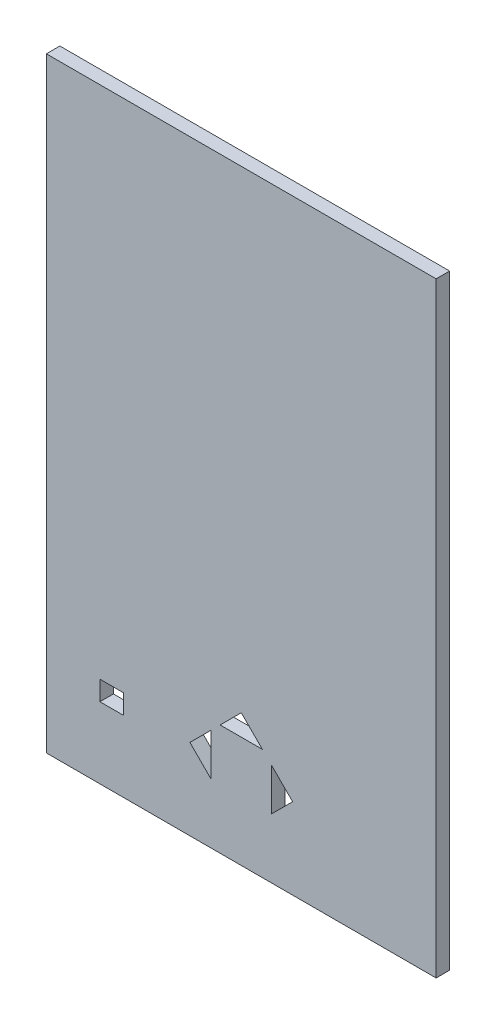
ISO-10303-21;
HEADER;
FILE_DESCRIPTION(('STEP AP214'),'2;1');
FILE_NAME('part.step','',(''),(''),'','','');
FILE_SCHEMA(('AUTOMOTIVE_DESIGN { 1 0 10303 214 1 1 1 1 }'));
ENDSEC;
DATA;
#1=APPLICATION_CONTEXT('core data for automotive mechanical design processes');
#2=APPLICATION_PROTOCOL_DEFINITION('international standard','automotive_design',2000,#1);
#3=PRODUCT_CONTEXT('',#1,'mechanical');
#4=PRODUCT('Part','Part','',(#3));
#5=PRODUCT_RELATED_PRODUCT_CATEGORY('part','',(#4));
#6=PRODUCT_DEFINITION_FORMATION('','',#4);
#7=PRODUCT_DEFINITION_CONTEXT('part definition',#1,'design');
#8=PRODUCT_DEFINITION('design','',#6,#7);
#9=PRODUCT_DEFINITION_SHAPE('','',#8);
#10=(LENGTH_UNIT() NAMED_UNIT(*) SI_UNIT(.MILLI.,.METRE.));
#11=(NAMED_UNIT(*) PLANE_ANGLE_UNIT() SI_UNIT($,.RADIAN.));
#12=(NAMED_UNIT(*) SI_UNIT($,.STERADIAN.) SOLID_ANGLE_UNIT());
#13=UNCERTAINTY_MEASURE_WITH_UNIT(LENGTH_MEASURE(1.E-05),#10,'distance_accuracy_value','');
#14=(GEOMETRIC_REPRESENTATION_CONTEXT(3) GLOBAL_UNCERTAINTY_ASSIGNED_CONTEXT((#13)) GLOBAL_UNIT_ASSIGNED_CONTEXT((#10,
#11,#12)) REPRESENTATION_CONTEXT('',''));
#15=CARTESIAN_POINT('',(0.,0.,0.));
#16=DIRECTION('',(0.,0.,1.));
#17=DIRECTION('',(1.,0.,0.));
#18=AXIS2_PLACEMENT_3D('',#15,#16,#17);
#19=CARTESIAN_POINT('',(-91.7625,142.5625,-6.35));
#20=DIRECTION('',(-1.,0.,0.));
#21=DIRECTION('',(0.,0.,1.));
#22=AXIS2_PLACEMENT_3D('',#19,#20,#21);
#23=PLANE('',#22);
#24=DIRECTION('',(0.,-1.,0.));
#25=VECTOR('',#24,1.);
#26=CARTESIAN_POINT('',(-91.7625,142.5625,0.));
#27=LINE('',#26,#25);
#28=CARTESIAN_POINT('',(-91.7625,142.5625,0.));
#29=VERTEX_POINT('',#28);
#30=CARTESIAN_POINT('',(-91.7625,-142.5625,0.));
#31=VERTEX_POINT('',#30);
#32=EDGE_CURVE('E184',#29,#31,#27,.T.);
#33=ORIENTED_EDGE('',*,*,#32,.F.);
#34=DIRECTION('',(0.,0.,1.));
#35=VECTOR('',#34,1.);
#36=CARTESIAN_POINT('',(-91.7625,142.5625,-6.35));
#37=LINE('',#36,#35);
#38=CARTESIAN_POINT('',(-91.7625,142.5625,-6.35));
#39=VERTEX_POINT('',#38);
#40=EDGE_CURVE('E11',#39,#29,#37,.T.);
#41=ORIENTED_EDGE('',*,*,#40,.F.);
#42=DIRECTION('',(0.,-1.,0.));
#43=VECTOR('',#42,1.);
#44=CARTESIAN_POINT('',(-91.7625,142.5625,-6.35));
#45=LINE('',#44,#43);
#46=CARTESIAN_POINT('',(-91.7625,-142.5625,-6.35));
#47=VERTEX_POINT('',#46);
#48=EDGE_CURVE('E263',#39,#47,#45,.T.);
#49=ORIENTED_EDGE('',*,*,#48,.T.);
#50=DIRECTION('',(0.,0.,1.));
#51=VECTOR('',#50,1.);
#52=CARTESIAN_POINT('',(-91.7625,-142.5625,-6.35));
#53=LINE('',#52,#51);
#54=EDGE_CURVE('E37',#47,#31,#53,.T.);
#55=ORIENTED_EDGE('',*,*,#54,.T.);
#56=EDGE_LOOP('',(#33,#41,#49,#55));
#57=FACE_BOUND('',#56,.T.);
#58=ADVANCED_FACE('F34',(#57),#23,.T.);
#59=CARTESIAN_POINT('',(91.7625,142.5625,-6.35));
#60=DIRECTION('',(0.,1.,0.));
#61=DIRECTION('',(0.,0.,1.));
#62=AXIS2_PLACEMENT_3D('',#59,#60,#61);
#63=PLANE('',#62);
#64=DIRECTION('',(-1.,0.,0.));
#65=VECTOR('',#64,1.);
#66=CARTESIAN_POINT('',(91.7625,142.5625,0.));
#67=LINE('',#66,#65);
#68=CARTESIAN_POINT('',(91.7625,142.5625,0.));
#69=VERTEX_POINT('',#68);
#70=EDGE_CURVE('E267',#69,#29,#67,.T.);
#71=ORIENTED_EDGE('',*,*,#70,.F.);
#72=DIRECTION('',(0.,0.,1.));
#73=VECTOR('',#72,1.);
#74=CARTESIAN_POINT('',(91.7625,142.5625,-6.35));
#75=LINE('',#74,#73);
#76=CARTESIAN_POINT('',(91.7625,142.5625,-6.35));
#77=VERTEX_POINT('',#76);
#78=EDGE_CURVE('E42',#77,#69,#75,.T.);
#79=ORIENTED_EDGE('',*,*,#78,.F.);
#80=DIRECTION('',(-1.,0.,0.));
#81=VECTOR('',#80,1.);
#82=CARTESIAN_POINT('',(91.7625,142.5625,-6.35));
#83=LINE('',#82,#81);
#84=EDGE_CURVE('E273',#77,#39,#83,.T.);
#85=ORIENTED_EDGE('',*,*,#84,.T.);
#86=ORIENTED_EDGE('',*,*,#40,.T.);
#87=EDGE_LOOP('',(#71,#79,#85,#86));
#88=FACE_BOUND('',#87,.T.);
#89=ADVANCED_FACE('F299',(#88),#63,.T.);
#90=CARTESIAN_POINT('',(91.7625,-142.5625,-6.35));
#91=DIRECTION('',(1.,0.,0.));
#92=DIRECTION('',(0.,0.,-1.));
#93=AXIS2_PLACEMENT_3D('',#90,#91,#92);
#94=PLANE('',#93);
#95=DIRECTION('',(0.,1.,0.));
#96=VECTOR('',#95,1.);
#97=CARTESIAN_POINT('',(91.7625,-142.5625,0.));
#98=LINE('',#97,#96);
#99=CARTESIAN_POINT('',(91.7625,-142.5625,0.));
#100=VERTEX_POINT('',#99);
#101=EDGE_CURVE('E281',#100,#69,#98,.T.);
#102=ORIENTED_EDGE('',*,*,#101,.F.);
#103=DIRECTION('',(0.,0.,1.));
#104=VECTOR('',#103,1.);
#105=CARTESIAN_POINT('',(91.7625,-142.5625,-6.35));
#106=LINE('',#105,#104);
#107=CARTESIAN_POINT('',(91.7625,-142.5625,-6.35));
#108=VERTEX_POINT('',#107);
#109=EDGE_CURVE('E286',#108,#100,#106,.T.);
#110=ORIENTED_EDGE('',*,*,#109,.F.);
#111=DIRECTION('',(0.,1.,0.));
#112=VECTOR('',#111,1.);
#113=CARTESIAN_POINT('',(91.7625,-142.5625,-6.35));
#114=LINE('',#113,#112);
#115=EDGE_CURVE('E270',#108,#77,#114,.T.);
#116=ORIENTED_EDGE('',*,*,#115,.T.);
#117=ORIENTED_EDGE('',*,*,#78,.T.);
#118=EDGE_LOOP('',(#102,#110,#116,#117));
#119=FACE_BOUND('',#118,.T.);
#120=ADVANCED_FACE('F304',(#119),#94,.T.);
#121=CARTESIAN_POINT('',(-91.7625,-142.5625,-6.35));
#122=DIRECTION('',(0.,-1.,0.));
#123=DIRECTION('',(0.,0.,-1.));
#124=AXIS2_PLACEMENT_3D('',#121,#122,#123);
#125=PLANE('',#124);
#126=DIRECTION('',(1.,0.,0.));
#127=VECTOR('',#126,1.);
#128=CARTESIAN_POINT('',(-91.7625,-142.5625,0.));
#129=LINE('',#128,#127);
#130=EDGE_CURVE('E278',#31,#100,#129,.T.);
#131=ORIENTED_EDGE('',*,*,#130,.F.);
#132=ORIENTED_EDGE('',*,*,#54,.F.);
#133=DIRECTION('',(1.,0.,0.));
#134=VECTOR('',#133,1.);
#135=CARTESIAN_POINT('',(-91.7625,-142.5625,-6.35));
#136=LINE('',#135,#134);
#137=EDGE_CURVE('E266',#47,#108,#136,.T.);
#138=ORIENTED_EDGE('',*,*,#137,.T.);
#139=ORIENTED_EDGE('',*,*,#109,.T.);
#140=EDGE_LOOP('',(#131,#132,#138,#139));
#141=FACE_BOUND('',#140,.T.);
#142=ADVANCED_FACE('F294',(#141),#125,.T.);
#143=CARTESIAN_POINT('',(0.,0.,-6.35));
#144=DIRECTION('',(0.,0.,1.));
#145=DIRECTION('',(1.,0.,0.));
#146=AXIS2_PLACEMENT_3D('',#143,#144,#145);
#147=PLANE('',#146);
#148=DIRECTION('',(0.,-1.,0.));
#149=VECTOR('',#148,1.);
#150=CARTESIAN_POINT('',(14.2369103576258,-94.5165584539816,-6.35));
#151=LINE('',#150,#149);
#152=CARTESIAN_POINT('',(14.2369103576258,-94.5165584539816,-6.35));
#153=VERTEX_POINT('',#152);
#154=CARTESIAN_POINT('',(14.2369103576258,-114.408441546018,-6.35));
#155=VERTEX_POINT('',#154);
#156=EDGE_CURVE('E50',#153,#155,#151,.T.);
#157=ORIENTED_EDGE('',*,*,#156,.T.);
#158=DIRECTION('',(0.707106781186548,0.707106781186547,0.));
#159=VECTOR('',#158,1.);
#160=CARTESIAN_POINT('',(14.2369103576258,-114.408441546018,-6.35));
#161=LINE('',#160,#159);
#162=CARTESIAN_POINT('',(24.1828519036442,-104.4625,-6.35));
#163=VERTEX_POINT('',#162);
#164=EDGE_CURVE('E157',#155,#163,#161,.T.);
#165=ORIENTED_EDGE('',*,*,#164,.T.);
#166=DIRECTION('',(-0.707106781186548,0.707106781186547,0.));
#167=VECTOR('',#166,1.);
#168=CARTESIAN_POINT('',(24.1828519036442,-104.4625,-6.35));
#169=LINE('',#168,#167);
#170=EDGE_CURVE('E166',#163,#153,#169,.T.);
#171=ORIENTED_EDGE('',*,*,#170,.T.);
#172=EDGE_LOOP('',(#157,#165,#171));
#173=FACE_BOUND('',#172,.T.);
#174=DIRECTION('',(1.,0.,0.));
#175=VECTOR('',#174,1.);
#176=CARTESIAN_POINT('',(-9.94594154601845,-90.2255896423743,-6.35));
#177=LINE('',#176,#175);
#178=CARTESIAN_POINT('',(-9.94594154601845,-90.2255896423743,-6.35));
#179=VERTEX_POINT('',#178);
#180=CARTESIAN_POINT('',(9.94594154601831,-90.2255896423742,-6.35));
#181=VERTEX_POINT('',#180);
#182=EDGE_CURVE('E58',#179,#181,#177,.T.);
#183=ORIENTED_EDGE('',*,*,#182,.T.);
#184=DIRECTION('',(-0.707106781186549,0.707106781186545,0.));
#185=VECTOR('',#184,1.);
#186=CARTESIAN_POINT('',(9.94594154601831,-90.2255896423742,-6.35));
#187=LINE('',#186,#185);
#188=CARTESIAN_POINT('',(0.,-80.2796480963558,-6.35));
#189=VERTEX_POINT('',#188);
#190=EDGE_CURVE('E186',#181,#189,#187,.T.);
#191=ORIENTED_EDGE('',*,*,#190,.T.);
#192=DIRECTION('',(-0.707106781186545,-0.70710678118655,0.));
#193=VECTOR('',#192,1.);
#194=CARTESIAN_POINT('',(0.,-80.2796480963558,-6.35));
#195=LINE('',#194,#193);
#196=EDGE_CURVE('E189',#189,#179,#195,.T.);
#197=ORIENTED_EDGE('',*,*,#196,.T.);
#198=EDGE_LOOP('',(#183,#191,#197));
#199=FACE_BOUND('',#198,.T.);
#200=DIRECTION('',(0.,1.,0.));
#201=VECTOR('',#200,1.);
#202=CARTESIAN_POINT('',(-14.2369103576257,-114.408441546018,-6.35));
#203=LINE('',#202,#201);
#204=CARTESIAN_POINT('',(-14.2369103576257,-114.408441546018,-6.35));
#205=VERTEX_POINT('',#204);
#206=CARTESIAN_POINT('',(-14.2369103576259,-94.5165584539817,-6.35));
#207=VERTEX_POINT('',#206);
#208=EDGE_CURVE('E215',#205,#207,#203,.T.);
#209=ORIENTED_EDGE('',*,*,#208,.T.);
#210=DIRECTION('',(-0.707106781186542,-0.707106781186553,0.));
#211=VECTOR('',#210,1.);
#212=CARTESIAN_POINT('',(-14.2369103576259,-94.5165584539817,-6.35));
#213=LINE('',#212,#211);
#214=CARTESIAN_POINT('',(-24.1828519036442,-104.4625,-6.35));
#215=VERTEX_POINT('',#214);
#216=EDGE_CURVE('E208',#207,#215,#213,.T.);
#217=ORIENTED_EDGE('',*,*,#216,.T.);
#218=DIRECTION('',(0.707106781186553,-0.707106781186542,0.));
#219=VECTOR('',#218,1.);
#220=CARTESIAN_POINT('',(-24.1828519036442,-104.4625,-6.35));
#221=LINE('',#220,#219);
#222=EDGE_CURVE('E211',#215,#205,#221,.T.);
#223=ORIENTED_EDGE('',*,*,#222,.T.);
#224=EDGE_LOOP('',(#209,#217,#223));
#225=FACE_BOUND('',#224,.T.);
#226=DIRECTION('',(-1.,0.,0.));
#227=VECTOR('',#226,1.);
#228=CARTESIAN_POINT('',(-55.359999897,-99.862499929,-6.35));
#229=LINE('',#228,#227);
#230=CARTESIAN_POINT('',(-55.359999897,-99.862499929,-6.35));
#231=VERTEX_POINT('',#230);
#232=CARTESIAN_POINT('',(-66.560000103,-99.862499929,-6.35));
#233=VERTEX_POINT('',#232);
#234=EDGE_CURVE('E242',#231,#233,#229,.T.);
#235=ORIENTED_EDGE('',*,*,#234,.T.);
#236=DIRECTION('',(0.,-1.,0.));
#237=VECTOR('',#236,1.);
#238=CARTESIAN_POINT('',(-66.560000103,-99.862499929,-6.35));
#239=LINE('',#238,#237);
#240=CARTESIAN_POINT('',(-66.560000103,-109.062500071,-6.35));
#241=VERTEX_POINT('',#240);
#242=EDGE_CURVE('E232',#233,#241,#239,.T.);
#243=ORIENTED_EDGE('',*,*,#242,.T.);
#244=DIRECTION('',(1.,0.,0.));
#245=VECTOR('',#244,1.);
#246=CARTESIAN_POINT('',(-55.359999897,-109.062500071,-6.35));
#247=LINE('',#246,#245);
#248=CARTESIAN_POINT('',(-55.359999897,-109.062500071,-6.35));
#249=VERTEX_POINT('',#248);
#250=EDGE_CURVE('E235',#241,#249,#247,.T.);
#251=ORIENTED_EDGE('',*,*,#250,.T.);
#252=DIRECTION('',(0.,1.,0.));
#253=VECTOR('',#252,1.);
#254=CARTESIAN_POINT('',(-55.359999897,-99.862499929,-6.35));
#255=LINE('',#254,#253);
#256=EDGE_CURVE('E239',#249,#231,#255,.T.);
#257=ORIENTED_EDGE('',*,*,#256,.T.);
#258=EDGE_LOOP('',(#235,#243,#251,#257));
#259=FACE_BOUND('',#258,.T.);
#260=ORIENTED_EDGE('',*,*,#48,.F.);
#261=ORIENTED_EDGE('',*,*,#84,.F.);
#262=ORIENTED_EDGE('',*,*,#115,.F.);
#263=ORIENTED_EDGE('',*,*,#137,.F.);
#264=EDGE_LOOP('',(#260,#261,#262,#263));
#265=FACE_BOUND('',#264,.T.);
#266=ADVANCED_FACE('F170',(#173,#199,#225,#259,#265),#147,.F.);
#267=CARTESIAN_POINT('',(0.,0.,0.));
#268=DIRECTION('',(0.,0.,1.));
#269=DIRECTION('',(1.,0.,0.));
#270=AXIS2_PLACEMENT_3D('',#267,#268,#269);
#271=PLANE('',#270);
#272=DIRECTION('',(0.707106781186548,0.707106781186547,0.));
#273=VECTOR('',#272,1.);
#274=CARTESIAN_POINT('',(14.2369103576258,-114.408441546018,0.));
#275=LINE('',#274,#273);
#276=CARTESIAN_POINT('',(14.2369103576258,-114.408441546018,0.));
#277=VERTEX_POINT('',#276);
#278=CARTESIAN_POINT('',(24.1828519036442,-104.4625,0.));
#279=VERTEX_POINT('',#278);
#280=EDGE_CURVE('E159',#277,#279,#275,.T.);
#281=ORIENTED_EDGE('',*,*,#280,.F.);
#282=DIRECTION('',(0.,-1.,0.));
#283=VECTOR('',#282,1.);
#284=CARTESIAN_POINT('',(14.2369103576258,-94.5165584539816,0.));
#285=LINE('',#284,#283);
#286=CARTESIAN_POINT('',(14.2369103576258,-94.5165584539816,0.));
#287=VERTEX_POINT('',#286);
#288=EDGE_CURVE('E172',#287,#277,#285,.T.);
#289=ORIENTED_EDGE('',*,*,#288,.F.);
#290=DIRECTION('',(-0.707106781186548,0.707106781186547,0.));
#291=VECTOR('',#290,1.);
#292=CARTESIAN_POINT('',(24.1828519036442,-104.4625,0.));
#293=LINE('',#292,#291);
#294=EDGE_CURVE('E175',#279,#287,#293,.T.);
#295=ORIENTED_EDGE('',*,*,#294,.F.);
#296=EDGE_LOOP('',(#281,#289,#295));
#297=FACE_BOUND('',#296,.T.);
#298=DIRECTION('',(-0.707106781186549,0.707106781186545,0.));
#299=VECTOR('',#298,1.);
#300=CARTESIAN_POINT('',(9.94594154601831,-90.2255896423742,0.));
#301=LINE('',#300,#299);
#302=CARTESIAN_POINT('',(9.94594154601831,-90.2255896423742,0.));
#303=VERTEX_POINT('',#302);
#304=CARTESIAN_POINT('',(0.,-80.2796480963558,0.));
#305=VERTEX_POINT('',#304);
#306=EDGE_CURVE('E195',#303,#305,#301,.T.);
#307=ORIENTED_EDGE('',*,*,#306,.F.);
#308=DIRECTION('',(1.,0.,0.));
#309=VECTOR('',#308,1.);
#310=CARTESIAN_POINT('',(-9.94594154601845,-90.2255896423743,0.));
#311=LINE('',#310,#309);
#312=CARTESIAN_POINT('',(-9.94594154601845,-90.2255896423743,0.));
#313=VERTEX_POINT('',#312);
#314=EDGE_CURVE('E190',#313,#303,#311,.T.);
#315=ORIENTED_EDGE('',*,*,#314,.F.);
#316=DIRECTION('',(-0.707106781186545,-0.70710678118655,0.));
#317=VECTOR('',#316,1.);
#318=CARTESIAN_POINT('',(0.,-80.2796480963558,0.));
#319=LINE('',#318,#317);
#320=EDGE_CURVE('E197',#305,#313,#319,.T.);
#321=ORIENTED_EDGE('',*,*,#320,.F.);
#322=EDGE_LOOP('',(#307,#315,#321));
#323=FACE_BOUND('',#322,.T.);
#324=DIRECTION('',(-0.707106781186542,-0.707106781186553,0.));
#325=VECTOR('',#324,1.);
#326=CARTESIAN_POINT('',(-14.2369103576259,-94.5165584539817,0.));
#327=LINE('',#326,#325);
#328=CARTESIAN_POINT('',(-14.2369103576259,-94.5165584539817,0.));
#329=VERTEX_POINT('',#328);
#330=CARTESIAN_POINT('',(-24.1828519036442,-104.4625,0.));
#331=VERTEX_POINT('',#330);
#332=EDGE_CURVE('E219',#329,#331,#327,.T.);
#333=ORIENTED_EDGE('',*,*,#332,.F.);
#334=DIRECTION('',(0.,1.,0.));
#335=VECTOR('',#334,1.);
#336=CARTESIAN_POINT('',(-14.2369103576257,-114.408441546018,0.));
#337=LINE('',#336,#335);
#338=CARTESIAN_POINT('',(-14.2369103576257,-114.408441546018,0.));
#339=VERTEX_POINT('',#338);
#340=EDGE_CURVE('E212',#339,#329,#337,.T.);
#341=ORIENTED_EDGE('',*,*,#340,.F.);
#342=DIRECTION('',(0.707106781186553,-0.707106781186542,0.));
#343=VECTOR('',#342,1.);
#344=CARTESIAN_POINT('',(-24.1828519036442,-104.4625,0.));
#345=LINE('',#344,#343);
#346=EDGE_CURVE('E221',#331,#339,#345,.T.);
#347=ORIENTED_EDGE('',*,*,#346,.F.);
#348=EDGE_LOOP('',(#333,#341,#347));
#349=FACE_BOUND('',#348,.T.);
#350=DIRECTION('',(0.,-1.,0.));
#351=VECTOR('',#350,1.);
#352=CARTESIAN_POINT('',(-66.560000103,-99.862499929,0.));
#353=LINE('',#352,#351);
#354=CARTESIAN_POINT('',(-66.560000103,-99.862499929,0.));
#355=VERTEX_POINT('',#354);
#356=CARTESIAN_POINT('',(-66.560000103,-109.062500071,0.));
#357=VERTEX_POINT('',#356);
#358=EDGE_CURVE('E246',#355,#357,#353,.T.);
#359=ORIENTED_EDGE('',*,*,#358,.F.);
#360=DIRECTION('',(-1.,0.,0.));
#361=VECTOR('',#360,1.);
#362=CARTESIAN_POINT('',(-55.359999897,-99.862499929,0.));
#363=LINE('',#362,#361);
#364=CARTESIAN_POINT('',(-55.359999897,-99.862499929,0.));
#365=VERTEX_POINT('',#364);
#366=EDGE_CURVE('E236',#365,#355,#363,.T.);
#367=ORIENTED_EDGE('',*,*,#366,.F.);
#368=DIRECTION('',(0.,1.,0.));
#369=VECTOR('',#368,1.);
#370=CARTESIAN_POINT('',(-55.359999897,-99.862499929,0.));
#371=LINE('',#370,#369);
#372=CARTESIAN_POINT('',(-55.359999897,-109.062500071,0.));
#373=VERTEX_POINT('',#372);
#374=EDGE_CURVE('E251',#373,#365,#371,.T.);
#375=ORIENTED_EDGE('',*,*,#374,.F.);
#376=DIRECTION('',(1.,0.,0.));
#377=VECTOR('',#376,1.);
#378=CARTESIAN_POINT('',(-55.359999897,-109.062500071,0.));
#379=LINE('',#378,#377);
#380=EDGE_CURVE('E248',#357,#373,#379,.T.);
#381=ORIENTED_EDGE('',*,*,#380,.F.);
#382=EDGE_LOOP('',(#359,#367,#375,#381));
#383=FACE_BOUND('',#382,.T.);
#384=ORIENTED_EDGE('',*,*,#32,.T.);
#385=ORIENTED_EDGE('',*,*,#130,.T.);
#386=ORIENTED_EDGE('',*,*,#101,.T.);
#387=ORIENTED_EDGE('',*,*,#70,.T.);
#388=EDGE_LOOP('',(#384,#385,#386,#387));
#389=FACE_BOUND('',#388,.T.);
#390=ADVANCED_FACE('F296',(#297,#323,#349,#383,#389),#271,.T.);
#391=CARTESIAN_POINT('',(-66.560000103,-99.862499929,-6.35));
#392=DIRECTION('',(-1.,0.,0.));
#393=DIRECTION('',(0.,0.,1.));
#394=AXIS2_PLACEMENT_3D('',#391,#392,#393);
#395=PLANE('',#394);
#396=ORIENTED_EDGE('',*,*,#358,.T.);
#397=DIRECTION('',(0.,0.,1.));
#398=VECTOR('',#397,1.);
#399=CARTESIAN_POINT('',(-66.560000103,-109.062500071,-6.35));
#400=LINE('',#399,#398);
#401=EDGE_CURVE('E245',#241,#357,#400,.T.);
#402=ORIENTED_EDGE('',*,*,#401,.F.);
#403=ORIENTED_EDGE('',*,*,#242,.F.);
#404=DIRECTION('',(0.,0.,1.));
#405=VECTOR('',#404,1.);
#406=CARTESIAN_POINT('',(-66.560000103,-99.862499929,-6.35));
#407=LINE('',#406,#405);
#408=EDGE_CURVE('E222',#233,#355,#407,.T.);
#409=ORIENTED_EDGE('',*,*,#408,.T.);
#410=EDGE_LOOP('',(#396,#402,#403,#409));
#411=FACE_BOUND('',#410,.T.);
#412=ADVANCED_FACE('F347',(#411),#395,.F.);
#413=CARTESIAN_POINT('',(-55.359999897,-99.862499929,-6.35));
#414=DIRECTION('',(0.,1.,0.));
#415=DIRECTION('',(0.,0.,1.));
#416=AXIS2_PLACEMENT_3D('',#413,#414,#415);
#417=PLANE('',#416);
#418=ORIENTED_EDGE('',*,*,#366,.T.);
#419=ORIENTED_EDGE('',*,*,#408,.F.);
#420=ORIENTED_EDGE('',*,*,#234,.F.);
#421=DIRECTION('',(0.,0.,1.));
#422=VECTOR('',#421,1.);
#423=CARTESIAN_POINT('',(-55.359999897,-99.862499929,-6.35));
#424=LINE('',#423,#422);
#425=EDGE_CURVE('E257',#231,#365,#424,.T.);
#426=ORIENTED_EDGE('',*,*,#425,.T.);
#427=EDGE_LOOP('',(#418,#419,#420,#426));
#428=FACE_BOUND('',#427,.T.);
#429=ADVANCED_FACE('F356',(#428),#417,.F.);
#430=CARTESIAN_POINT('',(-55.359999897,-99.862499929,-6.35));
#431=DIRECTION('',(1.,0.,0.));
#432=DIRECTION('',(0.,0.,-1.));
#433=AXIS2_PLACEMENT_3D('',#430,#431,#432);
#434=PLANE('',#433);
#435=ORIENTED_EDGE('',*,*,#374,.T.);
#436=ORIENTED_EDGE('',*,*,#425,.F.);
#437=ORIENTED_EDGE('',*,*,#256,.F.);
#438=DIRECTION('',(0.,0.,1.));
#439=VECTOR('',#438,1.);
#440=CARTESIAN_POINT('',(-55.359999897,-109.062500071,-6.35));
#441=LINE('',#440,#439);
#442=EDGE_CURVE('E259',#249,#373,#441,.T.);
#443=ORIENTED_EDGE('',*,*,#442,.T.);
#444=EDGE_LOOP('',(#435,#436,#437,#443));
#445=FACE_BOUND('',#444,.T.);
#446=ADVANCED_FACE('F366',(#445),#434,.F.);
#447=CARTESIAN_POINT('',(-55.359999897,-109.062500071,-6.35));
#448=DIRECTION('',(0.,-1.,0.));
#449=DIRECTION('',(1.,0.,0.));
#450=AXIS2_PLACEMENT_3D('',#447,#448,#449);
#451=PLANE('',#450);
#452=ORIENTED_EDGE('',*,*,#380,.T.);
#453=ORIENTED_EDGE('',*,*,#442,.F.);
#454=ORIENTED_EDGE('',*,*,#250,.F.);
#455=ORIENTED_EDGE('',*,*,#401,.T.);
#456=EDGE_LOOP('',(#452,#453,#454,#455));
#457=FACE_BOUND('',#456,.T.);
#458=ADVANCED_FACE('F376',(#457),#451,.F.);
#459=CARTESIAN_POINT('',(-14.2369103576259,-94.5165584539817,-6.35));
#460=DIRECTION('',(-0.707106781186553,0.707106781186542,0.));
#461=DIRECTION('',(-0.707106781186542,-0.707106781186553,0.));
#462=AXIS2_PLACEMENT_3D('',#459,#460,#461);
#463=PLANE('',#462);
#464=ORIENTED_EDGE('',*,*,#332,.T.);
#465=DIRECTION('',(0.,0.,1.));
#466=VECTOR('',#465,1.);
#467=CARTESIAN_POINT('',(-24.1828519036442,-104.4625,-6.35));
#468=LINE('',#467,#466);
#469=EDGE_CURVE('E218',#215,#331,#468,.T.);
#470=ORIENTED_EDGE('',*,*,#469,.F.);
#471=ORIENTED_EDGE('',*,*,#216,.F.);
#472=DIRECTION('',(0.,0.,1.));
#473=VECTOR('',#472,1.);
#474=CARTESIAN_POINT('',(-14.2369103576259,-94.5165584539817,-6.35));
#475=LINE('',#474,#473);
#476=EDGE_CURVE('E198',#207,#329,#475,.T.);
#477=ORIENTED_EDGE('',*,*,#476,.T.);
#478=EDGE_LOOP('',(#464,#470,#471,#477));
#479=FACE_BOUND('',#478,.T.);
#480=ADVANCED_FACE('F386',(#479),#463,.F.);
#481=CARTESIAN_POINT('',(-14.2369103576257,-114.408441546018,-6.35));
#482=DIRECTION('',(1.,0.,0.));
#483=DIRECTION('',(0.,1.,0.));
#484=AXIS2_PLACEMENT_3D('',#481,#482,#483);
#485=PLANE('',#484);
#486=ORIENTED_EDGE('',*,*,#340,.T.);
#487=ORIENTED_EDGE('',*,*,#476,.F.);
#488=ORIENTED_EDGE('',*,*,#208,.F.);
#489=DIRECTION('',(0.,0.,1.));
#490=VECTOR('',#489,1.);
#491=CARTESIAN_POINT('',(-14.2369103576257,-114.408441546018,-6.35));
#492=LINE('',#491,#490);
#493=EDGE_CURVE('E228',#205,#339,#492,.T.);
#494=ORIENTED_EDGE('',*,*,#493,.T.);
#495=EDGE_LOOP('',(#486,#487,#488,#494));
#496=FACE_BOUND('',#495,.T.);
#497=ADVANCED_FACE('F396',(#496),#485,.F.);
#498=CARTESIAN_POINT('',(-24.1828519036442,-104.4625,-6.35));
#499=DIRECTION('',(-0.707106781186542,-0.707106781186553,0.));
#500=DIRECTION('',(0.707106781186553,-0.707106781186542,0.));
#501=AXIS2_PLACEMENT_3D('',#498,#499,#500);
#502=PLANE('',#501);
#503=ORIENTED_EDGE('',*,*,#346,.T.);
#504=ORIENTED_EDGE('',*,*,#493,.F.);
#505=ORIENTED_EDGE('',*,*,#222,.F.);
#506=ORIENTED_EDGE('',*,*,#469,.T.);
#507=EDGE_LOOP('',(#503,#504,#505,#506));
#508=FACE_BOUND('',#507,.T.);
#509=ADVANCED_FACE('F406',(#508),#502,.F.);
#510=CARTESIAN_POINT('',(9.94594154601831,-90.2255896423742,-6.35));
#511=DIRECTION('',(0.707106781186545,0.707106781186549,0.));
#512=DIRECTION('',(-0.70710678118655,0.707106781186546,0.));
#513=AXIS2_PLACEMENT_3D('',#510,#511,#512);
#514=PLANE('',#513);
#515=ORIENTED_EDGE('',*,*,#306,.T.);
#516=DIRECTION('',(0.,0.,1.));
#517=VECTOR('',#516,1.);
#518=CARTESIAN_POINT('',(0.,-80.2796480963558,-6.35));
#519=LINE('',#518,#517);
#520=EDGE_CURVE('E194',#189,#305,#519,.T.);
#521=ORIENTED_EDGE('',*,*,#520,.F.);
#522=ORIENTED_EDGE('',*,*,#190,.F.);
#523=DIRECTION('',(0.,0.,1.));
#524=VECTOR('',#523,1.);
#525=CARTESIAN_POINT('',(9.94594154601831,-90.2255896423742,-6.35));
#526=LINE('',#525,#524);
#527=EDGE_CURVE('E180',#181,#303,#526,.T.);
#528=ORIENTED_EDGE('',*,*,#527,.T.);
#529=EDGE_LOOP('',(#515,#521,#522,#528));
#530=FACE_BOUND('',#529,.T.);
#531=ADVANCED_FACE('F416',(#530),#514,.F.);
#532=CARTESIAN_POINT('',(-9.94594154601845,-90.2255896423743,-6.35));
#533=DIRECTION('',(0.,-1.,0.));
#534=DIRECTION('',(1.,0.,0.));
#535=AXIS2_PLACEMENT_3D('',#532,#533,#534);
#536=PLANE('',#535);
#537=ORIENTED_EDGE('',*,*,#314,.T.);
#538=ORIENTED_EDGE('',*,*,#527,.F.);
#539=ORIENTED_EDGE('',*,*,#182,.F.);
#540=DIRECTION('',(0.,0.,1.));
#541=VECTOR('',#540,1.);
#542=CARTESIAN_POINT('',(-9.94594154601845,-90.2255896423743,-6.35));
#543=LINE('',#542,#541);
#544=EDGE_CURVE('E204',#179,#313,#543,.T.);
#545=ORIENTED_EDGE('',*,*,#544,.T.);
#546=EDGE_LOOP('',(#537,#538,#539,#545));
#547=FACE_BOUND('',#546,.T.);
#548=ADVANCED_FACE('F426',(#547),#536,.F.);
#549=CARTESIAN_POINT('',(0.,-80.2796480963558,-6.35));
#550=DIRECTION('',(-0.70710678118655,0.707106781186545,0.));
#551=DIRECTION('',(-0.707106781186545,-0.70710678118655,0.));
#552=AXIS2_PLACEMENT_3D('',#549,#550,#551);
#553=PLANE('',#552);
#554=ORIENTED_EDGE('',*,*,#320,.T.);
#555=ORIENTED_EDGE('',*,*,#544,.F.);
#556=ORIENTED_EDGE('',*,*,#196,.F.);
#557=ORIENTED_EDGE('',*,*,#520,.T.);
#558=EDGE_LOOP('',(#554,#555,#556,#557));
#559=FACE_BOUND('',#558,.T.);
#560=ADVANCED_FACE('F436',(#559),#553,.F.);
#561=CARTESIAN_POINT('',(14.2369103576258,-114.408441546018,-6.35));
#562=DIRECTION('',(0.707106781186547,-0.707106781186548,0.));
#563=DIRECTION('',(0.707106781186548,0.707106781186547,0.));
#564=AXIS2_PLACEMENT_3D('',#561,#562,#563);
#565=PLANE('',#564);
#566=ORIENTED_EDGE('',*,*,#280,.T.);
#567=DIRECTION('',(0.,0.,1.));
#568=VECTOR('',#567,1.);
#569=CARTESIAN_POINT('',(24.1828519036442,-104.4625,-6.35));
#570=LINE('',#569,#568);
#571=EDGE_CURVE('E153',#163,#279,#570,.T.);
#572=ORIENTED_EDGE('',*,*,#571,.F.);
#573=ORIENTED_EDGE('',*,*,#164,.F.);
#574=DIRECTION('',(0.,0.,1.));
#575=VECTOR('',#574,1.);
#576=CARTESIAN_POINT('',(14.2369103576258,-114.408441546018,-6.35));
#577=LINE('',#576,#575);
#578=EDGE_CURVE('E182',#155,#277,#577,.T.);
#579=ORIENTED_EDGE('',*,*,#578,.T.);
#580=EDGE_LOOP('',(#566,#572,#573,#579));
#581=FACE_BOUND('',#580,.T.);
#582=ADVANCED_FACE('F155',(#581),#565,.F.);
#583=CARTESIAN_POINT('',(14.2369103576258,-94.5165584539816,-6.35));
#584=DIRECTION('',(-1.,0.,0.));
#585=DIRECTION('',(0.,-1.,0.));
#586=AXIS2_PLACEMENT_3D('',#583,#584,#585);
#587=PLANE('',#586);
#588=ORIENTED_EDGE('',*,*,#288,.T.);
#589=ORIENTED_EDGE('',*,*,#578,.F.);
#590=ORIENTED_EDGE('',*,*,#156,.F.);
#591=DIRECTION('',(0.,0.,1.));
#592=VECTOR('',#591,1.);
#593=CARTESIAN_POINT('',(14.2369103576258,-94.5165584539816,-6.35));
#594=LINE('',#593,#592);
#595=EDGE_CURVE('E163',#153,#287,#594,.T.);
#596=ORIENTED_EDGE('',*,*,#595,.T.);
#597=EDGE_LOOP('',(#588,#589,#590,#596));
#598=FACE_BOUND('',#597,.T.);
#599=ADVANCED_FACE('F454',(#598),#587,.F.);
#600=CARTESIAN_POINT('',(24.1828519036442,-104.4625,-6.35));
#601=DIRECTION('',(0.707106781186547,0.707106781186548,0.));
#602=DIRECTION('',(-0.707106781186548,0.707106781186547,0.));
#603=AXIS2_PLACEMENT_3D('',#600,#601,#602);
#604=PLANE('',#603);
#605=ORIENTED_EDGE('',*,*,#294,.T.);
#606=ORIENTED_EDGE('',*,*,#595,.F.);
#607=ORIENTED_EDGE('',*,*,#170,.F.);
#608=ORIENTED_EDGE('',*,*,#571,.T.);
#609=EDGE_LOOP('',(#605,#606,#607,#608));
#610=FACE_BOUND('',#609,.T.);
#611=ADVANCED_FACE('F167',(#610),#604,.F.);
#612=CLOSED_SHELL('',(#58,#89,#120,#142,#266,#390,#412,#429,#446,#458,#480,#497,#509,#531,#548,
#560,#582,#599,#611));
#613=MANIFOLD_SOLID_BREP('B2',#612);
#614=ADVANCED_BREP_SHAPE_REPRESENTATION('',(#18,#613),#14);
#615=SHAPE_DEFINITION_REPRESENTATION(#9,#614);
ENDSEC;
END-ISO-10303-21;
